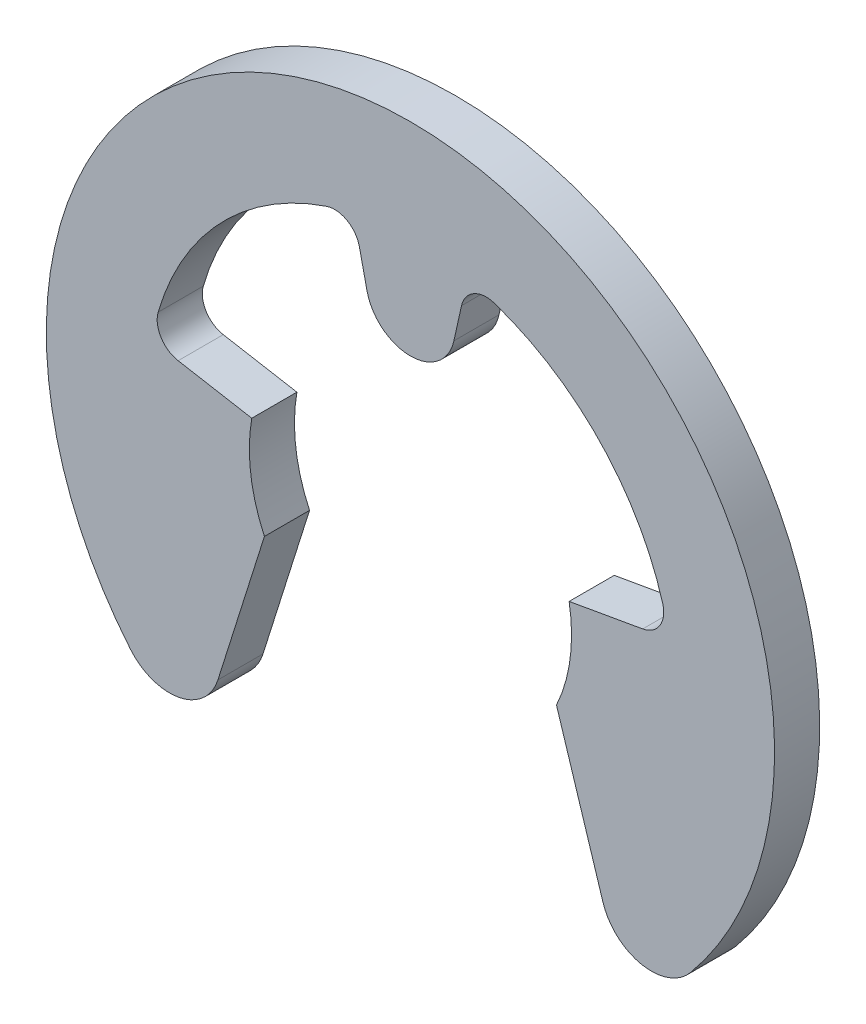
ISO-10303-21;
HEADER;
FILE_DESCRIPTION(('STEP AP214'),'2;1');
FILE_NAME('part.step','',(''),(''),'','','');
FILE_SCHEMA(('AUTOMOTIVE_DESIGN { 1 0 10303 214 1 1 1 1 }'));
ENDSEC;
DATA;
#1=APPLICATION_CONTEXT('core data for automotive mechanical design processes');
#2=APPLICATION_PROTOCOL_DEFINITION('international standard','automotive_design',2000,#1);
#3=PRODUCT_CONTEXT('',#1,'mechanical');
#4=PRODUCT('Part','Part','',(#3));
#5=PRODUCT_RELATED_PRODUCT_CATEGORY('part','',(#4));
#6=PRODUCT_DEFINITION_FORMATION('','',#4);
#7=PRODUCT_DEFINITION_CONTEXT('part definition',#1,'design');
#8=PRODUCT_DEFINITION('design','',#6,#7);
#9=PRODUCT_DEFINITION_SHAPE('','',#8);
#10=(LENGTH_UNIT() NAMED_UNIT(*) SI_UNIT(.MILLI.,.METRE.));
#11=(NAMED_UNIT(*) PLANE_ANGLE_UNIT() SI_UNIT($,.RADIAN.));
#12=(NAMED_UNIT(*) SI_UNIT($,.STERADIAN.) SOLID_ANGLE_UNIT());
#13=UNCERTAINTY_MEASURE_WITH_UNIT(LENGTH_MEASURE(1.E-05),#10,'distance_accuracy_value','');
#14=(GEOMETRIC_REPRESENTATION_CONTEXT(3) GLOBAL_UNCERTAINTY_ASSIGNED_CONTEXT((#13)) GLOBAL_UNIT_ASSIGNED_CONTEXT((#10,
#11,#12)) REPRESENTATION_CONTEXT('',''));
#15=CARTESIAN_POINT('',(0.,0.,0.));
#16=DIRECTION('',(0.,0.,1.));
#17=DIRECTION('',(1.,0.,0.));
#18=AXIS2_PLACEMENT_3D('',#15,#16,#17);
#19=CARTESIAN_POINT('',(0.,0.,-0.7));
#20=DIRECTION('',(0.,0.,1.));
#21=DIRECTION('',(1.,0.,0.));
#22=AXIS2_PLACEMENT_3D('',#19,#20,#21);
#23=CYLINDRICAL_SURFACE('',#22,2.5);
#24=CARTESIAN_POINT('',(0.,0.,0.));
#25=DIRECTION('',(0.,0.,-1.));
#26=DIRECTION('',(1.,0.,0.));
#27=AXIS2_PLACEMENT_3D('',#24,#25,#26);
#28=CIRCLE('',#27,2.5);
#29=CARTESIAN_POINT('',(2.46201938253052,0.434120444167318,0.));
#30=VERTEX_POINT('',#29);
#31=CARTESIAN_POINT('',(2.26576946759162,-1.05654565435176,0.));
#32=VERTEX_POINT('',#31);
#33=EDGE_CURVE('E198',#30,#32,#28,.T.);
#34=ORIENTED_EDGE('',*,*,#33,.F.);
#35=DIRECTION('',(0.,0.,1.));
#36=VECTOR('',#35,1.);
#37=CARTESIAN_POINT('',(2.46201938253052,0.434120444167318,-0.7));
#38=LINE('',#37,#36);
#39=CARTESIAN_POINT('',(2.46201938253052,0.434120444167318,-0.7));
#40=VERTEX_POINT('',#39);
#41=EDGE_CURVE('E13',#40,#30,#38,.T.);
#42=ORIENTED_EDGE('',*,*,#41,.F.);
#43=CARTESIAN_POINT('',(0.,0.,-0.7));
#44=DIRECTION('',(0.,0.,-1.));
#45=DIRECTION('',(1.,0.,0.));
#46=AXIS2_PLACEMENT_3D('',#43,#44,#45);
#47=CIRCLE('',#46,2.5);
#48=CARTESIAN_POINT('',(2.26576946759162,-1.05654565435176,-0.7));
#49=VERTEX_POINT('',#48);
#50=EDGE_CURVE('E248',#40,#49,#47,.T.);
#51=ORIENTED_EDGE('',*,*,#50,.T.);
#52=DIRECTION('',(0.,0.,1.));
#53=VECTOR('',#52,1.);
#54=CARTESIAN_POINT('',(2.26576946759162,-1.05654565435176,-0.7));
#55=LINE('',#54,#53);
#56=EDGE_CURVE('E44',#49,#32,#55,.T.);
#57=ORIENTED_EDGE('',*,*,#56,.T.);
#58=EDGE_LOOP('',(#34,#42,#51,#57));
#59=FACE_BOUND('',#58,.T.);
#60=ADVANCED_FACE('F41',(#59),#23,.F.);
#61=CARTESIAN_POINT('',(2.46201938253052,0.434120444167318,-0.7));
#62=DIRECTION('',(-0.173648177666928,0.984807753012209,0.));
#63=DIRECTION('',(-0.984807753012209,-0.173648177666928,0.));
#64=AXIS2_PLACEMENT_3D('',#61,#62,#63);
#65=PLANE('',#64);
#66=DIRECTION('',(-0.984807753012208,-0.173648177666928,0.));
#67=VECTOR('',#66,1.);
#68=CARTESIAN_POINT('',(2.46201938253052,0.434120444167318,0.));
#69=LINE('',#68,#67);
#70=CARTESIAN_POINT('',(3.60452586515531,0.635575162688392,0.));
#71=VERTEX_POINT('',#70);
#72=EDGE_CURVE('E246',#71,#30,#69,.T.);
#73=ORIENTED_EDGE('',*,*,#72,.F.);
#74=DIRECTION('',(0.,0.,1.));
#75=VECTOR('',#74,1.);
#76=CARTESIAN_POINT('',(3.60452586515531,0.635575162688392,-0.7));
#77=LINE('',#76,#75);
#78=CARTESIAN_POINT('',(3.60452586515531,0.635575162688392,-0.7));
#79=VERTEX_POINT('',#78);
#80=EDGE_CURVE('E50',#79,#71,#77,.T.);
#81=ORIENTED_EDGE('',*,*,#80,.F.);
#82=DIRECTION('',(-0.984807753012208,-0.173648177666928,0.));
#83=VECTOR('',#82,1.);
#84=CARTESIAN_POINT('',(2.46201938253052,0.434120444167318,-0.7));
#85=LINE('',#84,#83);
#86=EDGE_CURVE('E188',#79,#40,#85,.T.);
#87=ORIENTED_EDGE('',*,*,#86,.T.);
#88=ORIENTED_EDGE('',*,*,#41,.T.);
#89=EDGE_LOOP('',(#73,#81,#87,#88));
#90=FACE_BOUND('',#89,.T.);
#91=ADVANCED_FACE('F280',(#90),#65,.T.);
#92=CARTESIAN_POINT('',(3.53615189519896,1.02334321543695,-0.7));
#93=DIRECTION('',(0.,0.,1.));
#94=DIRECTION('',(1.,0.,0.));
#95=AXIS2_PLACEMENT_3D('',#92,#93,#94);
#96=CYLINDRICAL_SURFACE('',#95,0.39375);
#97=CARTESIAN_POINT('',(3.53615189519896,1.02334321543695,0.));
#98=DIRECTION('',(0.,0.,-1.));
#99=DIRECTION('',(1.,0.,0.));
#100=AXIS2_PLACEMENT_3D('',#97,#98,#99);
#101=CIRCLE('',#100,0.39375);
#102=CARTESIAN_POINT('',(3.91438206395538,1.13280097871798,0.));
#103=VERTEX_POINT('',#102);
#104=EDGE_CURVE('E175',#103,#71,#101,.T.);
#105=ORIENTED_EDGE('',*,*,#104,.F.);
#106=DIRECTION('',(0.,0.,1.));
#107=VECTOR('',#106,1.);
#108=CARTESIAN_POINT('',(3.91438206395538,1.13280097871798,-0.7));
#109=LINE('',#108,#107);
#110=CARTESIAN_POINT('',(3.91438206395538,1.13280097871798,-0.7));
#111=VERTEX_POINT('',#110);
#112=EDGE_CURVE('E170',#111,#103,#109,.T.);
#113=ORIENTED_EDGE('',*,*,#112,.F.);
#114=CARTESIAN_POINT('',(3.53615189519896,1.02334321543695,-0.7));
#115=DIRECTION('',(0.,0.,-1.));
#116=DIRECTION('',(1.,0.,0.));
#117=AXIS2_PLACEMENT_3D('',#114,#115,#116);
#118=CIRCLE('',#117,0.39375);
#119=EDGE_CURVE('E173',#111,#79,#118,.T.);
#120=ORIENTED_EDGE('',*,*,#119,.T.);
#121=ORIENTED_EDGE('',*,*,#80,.T.);
#122=EDGE_LOOP('',(#105,#113,#120,#121));
#123=FACE_BOUND('',#122,.T.);
#124=ADVANCED_FACE('F172',(#123),#96,.F.);
#125=CARTESIAN_POINT('',(0.,0.,-0.7));
#126=DIRECTION('',(0.,0.,1.));
#127=DIRECTION('',(1.,0.,0.));
#128=AXIS2_PLACEMENT_3D('',#125,#126,#127);
#129=CYLINDRICAL_SURFACE('',#128,4.075);
#130=CARTESIAN_POINT('',(0.,0.,0.));
#131=DIRECTION('',(0.,0.,-1.));
#132=DIRECTION('',(1.,0.,0.));
#133=AXIS2_PLACEMENT_3D('',#130,#131,#132);
#134=CIRCLE('',#133,4.075);
#135=CARTESIAN_POINT('',(1.30246575073799,3.86124435488801,0.));
#136=VERTEX_POINT('',#135);
#137=EDGE_CURVE('E243',#136,#103,#134,.T.);
#138=ORIENTED_EDGE('',*,*,#137,.F.);
#139=DIRECTION('',(0.,0.,1.));
#140=VECTOR('',#139,1.);
#141=CARTESIAN_POINT('',(1.30246575073799,3.86124435488801,-0.7));
#142=LINE('',#141,#140);
#143=CARTESIAN_POINT('',(1.30246575073799,3.86124435488801,-0.7));
#144=VERTEX_POINT('',#143);
#145=EDGE_CURVE('E180',#144,#136,#142,.T.);
#146=ORIENTED_EDGE('',*,*,#145,.F.);
#147=CARTESIAN_POINT('',(0.,0.,-0.7));
#148=DIRECTION('',(0.,0.,-1.));
#149=DIRECTION('',(1.,0.,0.));
#150=AXIS2_PLACEMENT_3D('',#147,#148,#149);
#151=CIRCLE('',#150,4.075);
#152=EDGE_CURVE('E186',#144,#111,#151,.T.);
#153=ORIENTED_EDGE('',*,*,#152,.T.);
#154=ORIENTED_EDGE('',*,*,#112,.T.);
#155=EDGE_LOOP('',(#138,#146,#153,#154));
#156=FACE_BOUND('',#155,.T.);
#157=ADVANCED_FACE('F190',(#156),#129,.F.);
#158=CARTESIAN_POINT('',(1.17661399874951,3.48814865802,-0.7));
#159=DIRECTION('',(0.,0.,1.));
#160=DIRECTION('',(1.,0.,0.));
#161=AXIS2_PLACEMENT_3D('',#158,#159,#160);
#162=CYLINDRICAL_SURFACE('',#161,0.39375);
#163=CARTESIAN_POINT('',(1.17661399874951,3.48814865802,0.));
#164=DIRECTION('',(0.,0.,-1.));
#165=DIRECTION('',(1.,0.,0.));
#166=AXIS2_PLACEMENT_3D('',#163,#164,#165);
#167=CIRCLE('',#166,0.39375);
#168=CARTESIAN_POINT('',(0.792197445946035,3.57337175600812,0.));
#169=VERTEX_POINT('',#168);
#170=EDGE_CURVE('E240',#169,#136,#167,.T.);
#171=ORIENTED_EDGE('',*,*,#170,.F.);
#172=DIRECTION('',(0.,0.,1.));
#173=VECTOR('',#172,1.);
#174=CARTESIAN_POINT('',(0.792197445946035,3.57337175600812,-0.7));
#175=LINE('',#174,#173);
#176=CARTESIAN_POINT('',(0.792197445946035,3.57337175600812,-0.7));
#177=VERTEX_POINT('',#176);
#178=EDGE_CURVE('E252',#177,#169,#175,.T.);
#179=ORIENTED_EDGE('',*,*,#178,.F.);
#180=CARTESIAN_POINT('',(1.17661399874951,3.48814865802,-0.7));
#181=DIRECTION('',(0.,0.,-1.));
#182=DIRECTION('',(1.,0.,0.));
#183=AXIS2_PLACEMENT_3D('',#180,#181,#182);
#184=CIRCLE('',#183,0.39375);
#185=EDGE_CURVE('E191',#177,#144,#184,.T.);
#186=ORIENTED_EDGE('',*,*,#185,.T.);
#187=ORIENTED_EDGE('',*,*,#145,.T.);
#188=EDGE_LOOP('',(#171,#179,#186,#187));
#189=FACE_BOUND('',#188,.T.);
#190=ADVANCED_FACE('F293',(#189),#162,.F.);
#191=CARTESIAN_POINT('',(0.674195424593791,3.04109903484525,-0.7));
#192=DIRECTION('',(0.976296007119933,-0.216439613938103,0.));
#193=DIRECTION('',(0.216439613938103,0.976296007119933,0.));
#194=AXIS2_PLACEMENT_3D('',#191,#192,#193);
#195=PLANE('',#194);
#196=DIRECTION('',(0.216439613938103,0.976296007119933,0.));
#197=VECTOR('',#196,1.);
#198=CARTESIAN_POINT('',(0.674195424593791,3.04109903484525,0.));
#199=LINE('',#198,#197);
#200=CARTESIAN_POINT('',(0.674195424593791,3.04109903484525,0.));
#201=VERTEX_POINT('',#200);
#202=EDGE_CURVE('E237',#201,#169,#199,.T.);
#203=ORIENTED_EDGE('',*,*,#202,.F.);
#204=DIRECTION('',(0.,0.,1.));
#205=VECTOR('',#204,1.);
#206=CARTESIAN_POINT('',(0.674195424593791,3.04109903484525,-0.7));
#207=LINE('',#206,#205);
#208=CARTESIAN_POINT('',(0.674195424593791,3.04109903484525,-0.7));
#209=VERTEX_POINT('',#208);
#210=EDGE_CURVE('E254',#209,#201,#207,.T.);
#211=ORIENTED_EDGE('',*,*,#210,.F.);
#212=DIRECTION('',(0.216439613938103,0.976296007119933,0.));
#213=VECTOR('',#212,1.);
#214=CARTESIAN_POINT('',(0.674195424593791,3.04109903484525,-0.7));
#215=LINE('',#214,#213);
#216=EDGE_CURVE('E193',#209,#177,#215,.T.);
#217=ORIENTED_EDGE('',*,*,#216,.T.);
#218=ORIENTED_EDGE('',*,*,#178,.T.);
#219=EDGE_LOOP('',(#203,#211,#217,#218));
#220=FACE_BOUND('',#219,.T.);
#221=ADVANCED_FACE('F296',(#220),#195,.T.);
#222=CARTESIAN_POINT('',(0.,3.19056456205598,-0.7));
#223=DIRECTION('',(0.,0.,1.));
#224=DIRECTION('',(1.,0.,0.));
#225=AXIS2_PLACEMENT_3D('',#222,#223,#224);
#226=CYLINDRICAL_SURFACE('',#225,0.690564562055992);
#227=CARTESIAN_POINT('',(0.,3.19056456205598,0.));
#228=DIRECTION('',(0.,0.,1.));
#229=DIRECTION('',(1.,0.,0.));
#230=AXIS2_PLACEMENT_3D('',#227,#228,#229);
#231=CIRCLE('',#230,0.690564562055992);
#232=CARTESIAN_POINT('',(-0.674195424593791,3.04109903484525,0.));
#233=VERTEX_POINT('',#232);
#234=EDGE_CURVE('E234',#233,#201,#231,.T.);
#235=ORIENTED_EDGE('',*,*,#234,.F.);
#236=DIRECTION('',(0.,0.,1.));
#237=VECTOR('',#236,1.);
#238=CARTESIAN_POINT('',(-0.674195424593791,3.04109903484525,-0.7));
#239=LINE('',#238,#237);
#240=CARTESIAN_POINT('',(-0.674195424593791,3.04109903484525,-0.7));
#241=VERTEX_POINT('',#240);
#242=EDGE_CURVE('E256',#241,#233,#239,.T.);
#243=ORIENTED_EDGE('',*,*,#242,.F.);
#244=CARTESIAN_POINT('',(0.,3.19056456205598,-0.7));
#245=DIRECTION('',(0.,0.,1.));
#246=DIRECTION('',(1.,0.,0.));
#247=AXIS2_PLACEMENT_3D('',#244,#245,#246);
#248=CIRCLE('',#247,0.690564562055992);
#249=EDGE_CURVE('E504',#241,#209,#248,.T.);
#250=ORIENTED_EDGE('',*,*,#249,.T.);
#251=ORIENTED_EDGE('',*,*,#210,.T.);
#252=EDGE_LOOP('',(#235,#243,#250,#251));
#253=FACE_BOUND('',#252,.T.);
#254=ADVANCED_FACE('F300',(#253),#226,.T.);
#255=CARTESIAN_POINT('',(-0.674195424593791,3.04109903484525,-0.7));
#256=DIRECTION('',(-0.976296007119933,-0.216439613938103,0.));
#257=DIRECTION('',(0.216439613938103,-0.976296007119933,0.));
#258=AXIS2_PLACEMENT_3D('',#255,#256,#257);
#259=PLANE('',#258);
#260=DIRECTION('',(0.216439613938103,-0.976296007119933,0.));
#261=VECTOR('',#260,1.);
#262=CARTESIAN_POINT('',(-0.674195424593791,3.04109903484525,0.));
#263=LINE('',#262,#261);
#264=CARTESIAN_POINT('',(-0.792197445946034,3.57337175600812,0.));
#265=VERTEX_POINT('',#264);
#266=EDGE_CURVE('E231',#265,#233,#263,.T.);
#267=ORIENTED_EDGE('',*,*,#266,.F.);
#268=DIRECTION('',(0.,0.,1.));
#269=VECTOR('',#268,1.);
#270=CARTESIAN_POINT('',(-0.792197445946034,3.57337175600812,-0.7));
#271=LINE('',#270,#269);
#272=CARTESIAN_POINT('',(-0.792197445946034,3.57337175600812,-0.7));
#273=VERTEX_POINT('',#272);
#274=EDGE_CURVE('E258',#273,#265,#271,.T.);
#275=ORIENTED_EDGE('',*,*,#274,.F.);
#276=DIRECTION('',(0.216439613938103,-0.976296007119933,0.));
#277=VECTOR('',#276,1.);
#278=CARTESIAN_POINT('',(-0.674195424593791,3.04109903484525,-0.7));
#279=LINE('',#278,#277);
#280=EDGE_CURVE('E508',#273,#241,#279,.T.);
#281=ORIENTED_EDGE('',*,*,#280,.T.);
#282=ORIENTED_EDGE('',*,*,#242,.T.);
#283=EDGE_LOOP('',(#267,#275,#281,#282));
#284=FACE_BOUND('',#283,.T.);
#285=ADVANCED_FACE('F304',(#284),#259,.T.);
#286=CARTESIAN_POINT('',(-1.17661399874951,3.48814865802,-0.7));
#287=DIRECTION('',(0.,0.,1.));
#288=DIRECTION('',(1.,0.,0.));
#289=AXIS2_PLACEMENT_3D('',#286,#287,#288);
#290=CYLINDRICAL_SURFACE('',#289,0.39375);
#291=CARTESIAN_POINT('',(-1.17661399874951,3.48814865802,0.));
#292=DIRECTION('',(0.,0.,-1.));
#293=DIRECTION('',(1.,0.,0.));
#294=AXIS2_PLACEMENT_3D('',#291,#292,#293);
#295=CIRCLE('',#294,0.39375);
#296=CARTESIAN_POINT('',(-1.302465750738,3.86124435488801,0.));
#297=VERTEX_POINT('',#296);
#298=EDGE_CURVE('E228',#297,#265,#295,.T.);
#299=ORIENTED_EDGE('',*,*,#298,.F.);
#300=DIRECTION('',(0.,0.,1.));
#301=VECTOR('',#300,1.);
#302=CARTESIAN_POINT('',(-1.302465750738,3.86124435488801,-0.7));
#303=LINE('',#302,#301);
#304=CARTESIAN_POINT('',(-1.302465750738,3.86124435488801,-0.7));
#305=VERTEX_POINT('',#304);
#306=EDGE_CURVE('E260',#305,#297,#303,.T.);
#307=ORIENTED_EDGE('',*,*,#306,.F.);
#308=CARTESIAN_POINT('',(-1.17661399874951,3.48814865802,-0.7));
#309=DIRECTION('',(0.,0.,-1.));
#310=DIRECTION('',(1.,0.,0.));
#311=AXIS2_PLACEMENT_3D('',#308,#309,#310);
#312=CIRCLE('',#311,0.39375);
#313=EDGE_CURVE('E497',#305,#273,#312,.T.);
#314=ORIENTED_EDGE('',*,*,#313,.T.);
#315=ORIENTED_EDGE('',*,*,#274,.T.);
#316=EDGE_LOOP('',(#299,#307,#314,#315));
#317=FACE_BOUND('',#316,.T.);
#318=ADVANCED_FACE('F308',(#317),#290,.F.);
#319=CARTESIAN_POINT('',(0.,0.,-0.7));
#320=DIRECTION('',(0.,0.,1.));
#321=DIRECTION('',(1.,0.,0.));
#322=AXIS2_PLACEMENT_3D('',#319,#320,#321);
#323=CYLINDRICAL_SURFACE('',#322,4.075);
#324=CARTESIAN_POINT('',(0.,0.,0.));
#325=DIRECTION('',(0.,0.,-1.));
#326=DIRECTION('',(1.,0.,0.));
#327=AXIS2_PLACEMENT_3D('',#324,#325,#326);
#328=CIRCLE('',#327,4.075);
#329=CARTESIAN_POINT('',(-3.91438206395538,1.13280097871798,0.));
#330=VERTEX_POINT('',#329);
#331=EDGE_CURVE('E225',#330,#297,#328,.T.);
#332=ORIENTED_EDGE('',*,*,#331,.F.);
#333=DIRECTION('',(0.,0.,1.));
#334=VECTOR('',#333,1.);
#335=CARTESIAN_POINT('',(-3.91438206395538,1.13280097871798,-0.7));
#336=LINE('',#335,#334);
#337=CARTESIAN_POINT('',(-3.91438206395538,1.13280097871798,-0.7));
#338=VERTEX_POINT('',#337);
#339=EDGE_CURVE('E262',#338,#330,#336,.T.);
#340=ORIENTED_EDGE('',*,*,#339,.F.);
#341=CARTESIAN_POINT('',(0.,0.,-0.7));
#342=DIRECTION('',(0.,0.,-1.));
#343=DIRECTION('',(1.,0.,0.));
#344=AXIS2_PLACEMENT_3D('',#341,#342,#343);
#345=CIRCLE('',#344,4.075);
#346=EDGE_CURVE('E493',#338,#305,#345,.T.);
#347=ORIENTED_EDGE('',*,*,#346,.T.);
#348=ORIENTED_EDGE('',*,*,#306,.T.);
#349=EDGE_LOOP('',(#332,#340,#347,#348));
#350=FACE_BOUND('',#349,.T.);
#351=ADVANCED_FACE('F312',(#350),#323,.F.);
#352=CARTESIAN_POINT('',(-3.53615189519896,1.02334321543695,-0.7));
#353=DIRECTION('',(0.,0.,1.));
#354=DIRECTION('',(1.,0.,0.));
#355=AXIS2_PLACEMENT_3D('',#352,#353,#354);
#356=CYLINDRICAL_SURFACE('',#355,0.39375);
#357=CARTESIAN_POINT('',(-3.53615189519896,1.02334321543695,0.));
#358=DIRECTION('',(0.,0.,-1.));
#359=DIRECTION('',(1.,0.,0.));
#360=AXIS2_PLACEMENT_3D('',#357,#358,#359);
#361=CIRCLE('',#360,0.39375);
#362=CARTESIAN_POINT('',(-3.60452586515531,0.635575162688392,0.));
#363=VERTEX_POINT('',#362);
#364=EDGE_CURVE('E222',#363,#330,#361,.T.);
#365=ORIENTED_EDGE('',*,*,#364,.F.);
#366=DIRECTION('',(0.,0.,1.));
#367=VECTOR('',#366,1.);
#368=CARTESIAN_POINT('',(-3.60452586515531,0.635575162688392,-0.7));
#369=LINE('',#368,#367);
#370=CARTESIAN_POINT('',(-3.60452586515531,0.635575162688392,-0.7));
#371=VERTEX_POINT('',#370);
#372=EDGE_CURVE('E264',#371,#363,#369,.T.);
#373=ORIENTED_EDGE('',*,*,#372,.F.);
#374=CARTESIAN_POINT('',(-3.53615189519896,1.02334321543695,-0.7));
#375=DIRECTION('',(0.,0.,-1.));
#376=DIRECTION('',(1.,0.,0.));
#377=AXIS2_PLACEMENT_3D('',#374,#375,#376);
#378=CIRCLE('',#377,0.39375);
#379=EDGE_CURVE('E514',#371,#338,#378,.T.);
#380=ORIENTED_EDGE('',*,*,#379,.T.);
#381=ORIENTED_EDGE('',*,*,#339,.T.);
#382=EDGE_LOOP('',(#365,#373,#380,#381));
#383=FACE_BOUND('',#382,.T.);
#384=ADVANCED_FACE('F316',(#383),#356,.F.);
#385=CARTESIAN_POINT('',(-2.46201938253052,0.434120444167318,-0.7));
#386=DIRECTION('',(0.173648177666928,0.984807753012209,0.));
#387=DIRECTION('',(-0.984807753012209,0.173648177666928,0.));
#388=AXIS2_PLACEMENT_3D('',#385,#386,#387);
#389=PLANE('',#388);
#390=DIRECTION('',(-0.984807753012208,0.173648177666928,0.));
#391=VECTOR('',#390,1.);
#392=CARTESIAN_POINT('',(-2.46201938253052,0.434120444167318,0.));
#393=LINE('',#392,#391);
#394=CARTESIAN_POINT('',(-2.46201938253052,0.434120444167318,0.));
#395=VERTEX_POINT('',#394);
#396=EDGE_CURVE('E219',#395,#363,#393,.T.);
#397=ORIENTED_EDGE('',*,*,#396,.F.);
#398=DIRECTION('',(0.,0.,1.));
#399=VECTOR('',#398,1.);
#400=CARTESIAN_POINT('',(-2.46201938253052,0.434120444167318,-0.7));
#401=LINE('',#400,#399);
#402=CARTESIAN_POINT('',(-2.46201938253052,0.434120444167318,-0.7));
#403=VERTEX_POINT('',#402);
#404=EDGE_CURVE('E266',#403,#395,#401,.T.);
#405=ORIENTED_EDGE('',*,*,#404,.F.);
#406=DIRECTION('',(-0.984807753012208,0.173648177666928,0.));
#407=VECTOR('',#406,1.);
#408=CARTESIAN_POINT('',(-2.46201938253052,0.434120444167318,-0.7));
#409=LINE('',#408,#407);
#410=EDGE_CURVE('E486',#403,#371,#409,.T.);
#411=ORIENTED_EDGE('',*,*,#410,.T.);
#412=ORIENTED_EDGE('',*,*,#372,.T.);
#413=EDGE_LOOP('',(#397,#405,#411,#412));
#414=FACE_BOUND('',#413,.T.);
#415=ADVANCED_FACE('F320',(#414),#389,.T.);
#416=CARTESIAN_POINT('',(0.,0.,-0.7));
#417=DIRECTION('',(0.,0.,1.));
#418=DIRECTION('',(1.,0.,0.));
#419=AXIS2_PLACEMENT_3D('',#416,#417,#418);
#420=CYLINDRICAL_SURFACE('',#419,2.5);
#421=CARTESIAN_POINT('',(0.,0.,0.));
#422=DIRECTION('',(0.,0.,-1.));
#423=DIRECTION('',(1.,0.,0.));
#424=AXIS2_PLACEMENT_3D('',#421,#422,#423);
#425=CIRCLE('',#424,2.5);
#426=CARTESIAN_POINT('',(-2.26576946759162,-1.05654565435176,0.));
#427=VERTEX_POINT('',#426);
#428=EDGE_CURVE('E216',#427,#395,#425,.T.);
#429=ORIENTED_EDGE('',*,*,#428,.F.);
#430=DIRECTION('',(0.,0.,1.));
#431=VECTOR('',#430,1.);
#432=CARTESIAN_POINT('',(-2.26576946759162,-1.05654565435176,-0.7));
#433=LINE('',#432,#431);
#434=CARTESIAN_POINT('',(-2.26576946759162,-1.05654565435176,-0.7));
#435=VERTEX_POINT('',#434);
#436=EDGE_CURVE('E268',#435,#427,#433,.T.);
#437=ORIENTED_EDGE('',*,*,#436,.F.);
#438=CARTESIAN_POINT('',(0.,0.,-0.7));
#439=DIRECTION('',(0.,0.,-1.));
#440=DIRECTION('',(1.,0.,0.));
#441=AXIS2_PLACEMENT_3D('',#438,#439,#440);
#442=CIRCLE('',#441,2.5);
#443=EDGE_CURVE('E482',#435,#403,#442,.T.);
#444=ORIENTED_EDGE('',*,*,#443,.T.);
#445=ORIENTED_EDGE('',*,*,#404,.T.);
#446=EDGE_LOOP('',(#429,#437,#444,#445));
#447=FACE_BOUND('',#446,.T.);
#448=ADVANCED_FACE('F324',(#447),#420,.F.);
#449=CARTESIAN_POINT('',(-2.26576946759162,-1.05654565435176,-0.7));
#450=DIRECTION('',(0.953716950748227,-0.300705799504273,0.));
#451=DIRECTION('',(0.300705799504273,0.953716950748227,0.));
#452=AXIS2_PLACEMENT_3D('',#449,#450,#451);
#453=PLANE('',#452);
#454=DIRECTION('',(0.300705799504273,0.953716950748227,0.));
#455=VECTOR('',#454,1.);
#456=CARTESIAN_POINT('',(-2.26576946759162,-1.05654565435176,0.));
#457=LINE('',#456,#455);
#458=CARTESIAN_POINT('',(-2.98759714932915,-3.34589057795238,0.));
#459=VERTEX_POINT('',#458);
#460=EDGE_CURVE('E213',#459,#427,#457,.T.);
#461=ORIENTED_EDGE('',*,*,#460,.F.);
#462=DIRECTION('',(0.,0.,1.));
#463=VECTOR('',#462,1.);
#464=CARTESIAN_POINT('',(-2.98759714932915,-3.34589057795238,-0.7));
#465=LINE('',#464,#463);
#466=CARTESIAN_POINT('',(-2.98759714932915,-3.34589057795238,-0.7));
#467=VERTEX_POINT('',#466);
#468=EDGE_CURVE('E270',#467,#459,#465,.T.);
#469=ORIENTED_EDGE('',*,*,#468,.F.);
#470=DIRECTION('',(0.300705799504273,0.953716950748227,0.));
#471=VECTOR('',#470,1.);
#472=CARTESIAN_POINT('',(-2.26576946759162,-1.05654565435176,-0.7));
#473=LINE('',#472,#471);
#474=EDGE_CURVE('E518',#467,#435,#473,.T.);
#475=ORIENTED_EDGE('',*,*,#474,.T.);
#476=ORIENTED_EDGE('',*,*,#436,.T.);
#477=EDGE_LOOP('',(#461,#469,#475,#476));
#478=FACE_BOUND('',#477,.T.);
#479=ADVANCED_FACE('F328',(#478),#453,.T.);
#480=CARTESIAN_POINT('',(-3.73864924804338,-3.10908476084276,-0.7));
#481=DIRECTION('',(0.,0.,1.));
#482=DIRECTION('',(1.,0.,0.));
#483=AXIS2_PLACEMENT_3D('',#480,#481,#482);
#484=CYLINDRICAL_SURFACE('',#483,0.7875);
#485=CARTESIAN_POINT('',(-3.73864924804338,-3.10908476084276,0.));
#486=DIRECTION('',(0.,0.,1.));
#487=DIRECTION('',(1.,0.,0.));
#488=AXIS2_PLACEMENT_3D('',#485,#486,#487);
#489=CIRCLE('',#488,0.7875);
#490=CARTESIAN_POINT('',(-4.3441374296031,-3.61261262699468,0.));
#491=VERTEX_POINT('',#490);
#492=EDGE_CURVE('E210',#491,#459,#489,.T.);
#493=ORIENTED_EDGE('',*,*,#492,.F.);
#494=DIRECTION('',(0.,0.,1.));
#495=VECTOR('',#494,1.);
#496=CARTESIAN_POINT('',(-4.3441374296031,-3.61261262699468,-0.7));
#497=LINE('',#496,#495);
#498=CARTESIAN_POINT('',(-4.3441374296031,-3.61261262699468,-0.7));
#499=VERTEX_POINT('',#498);
#500=EDGE_CURVE('E272',#499,#491,#497,.T.);
#501=ORIENTED_EDGE('',*,*,#500,.F.);
#502=CARTESIAN_POINT('',(-3.73864924804338,-3.10908476084276,-0.7));
#503=DIRECTION('',(0.,0.,1.));
#504=DIRECTION('',(1.,0.,0.));
#505=AXIS2_PLACEMENT_3D('',#502,#503,#504);
#506=CIRCLE('',#505,0.7875);
#507=EDGE_CURVE('E475',#499,#467,#506,.T.);
#508=ORIENTED_EDGE('',*,*,#507,.T.);
#509=ORIENTED_EDGE('',*,*,#468,.T.);
#510=EDGE_LOOP('',(#493,#501,#508,#509));
#511=FACE_BOUND('',#510,.T.);
#512=ADVANCED_FACE('F332',(#511),#484,.T.);
#513=CARTESIAN_POINT('',(0.,0.,-0.7));
#514=DIRECTION('',(0.,0.,1.));
#515=DIRECTION('',(1.,0.,0.));
#516=AXIS2_PLACEMENT_3D('',#513,#514,#515);
#517=CYLINDRICAL_SURFACE('',#516,5.65);
#518=CARTESIAN_POINT('',(0.,0.,0.));
#519=DIRECTION('',(0.,0.,1.));
#520=DIRECTION('',(1.,0.,0.));
#521=AXIS2_PLACEMENT_3D('',#518,#519,#520);
#522=CIRCLE('',#521,5.65);
#523=CARTESIAN_POINT('',(4.3441374296031,-3.61261262699468,0.));
#524=VERTEX_POINT('',#523);
#525=EDGE_CURVE('E207',#524,#491,#522,.T.);
#526=ORIENTED_EDGE('',*,*,#525,.F.);
#527=DIRECTION('',(0.,0.,1.));
#528=VECTOR('',#527,1.);
#529=CARTESIAN_POINT('',(4.3441374296031,-3.61261262699468,-0.7));
#530=LINE('',#529,#528);
#531=CARTESIAN_POINT('',(4.3441374296031,-3.61261262699468,-0.7));
#532=VERTEX_POINT('',#531);
#533=EDGE_CURVE('E274',#532,#524,#530,.T.);
#534=ORIENTED_EDGE('',*,*,#533,.F.);
#535=CARTESIAN_POINT('',(0.,0.,-0.7));
#536=DIRECTION('',(0.,0.,1.));
#537=DIRECTION('',(1.,0.,0.));
#538=AXIS2_PLACEMENT_3D('',#535,#536,#537);
#539=CIRCLE('',#538,5.65);
#540=EDGE_CURVE('E471',#532,#499,#539,.T.);
#541=ORIENTED_EDGE('',*,*,#540,.T.);
#542=ORIENTED_EDGE('',*,*,#500,.T.);
#543=EDGE_LOOP('',(#526,#534,#541,#542));
#544=FACE_BOUND('',#543,.T.);
#545=ADVANCED_FACE('F336',(#544),#517,.T.);
#546=CARTESIAN_POINT('',(3.73864924804338,-3.10908476084276,-0.7));
#547=DIRECTION('',(0.,0.,1.));
#548=DIRECTION('',(1.,0.,0.));
#549=AXIS2_PLACEMENT_3D('',#546,#547,#548);
#550=CYLINDRICAL_SURFACE('',#549,0.7875);
#551=CARTESIAN_POINT('',(3.73864924804338,-3.10908476084276,0.));
#552=DIRECTION('',(0.,0.,1.));
#553=DIRECTION('',(1.,0.,0.));
#554=AXIS2_PLACEMENT_3D('',#551,#552,#553);
#555=CIRCLE('',#554,0.7875);
#556=CARTESIAN_POINT('',(2.98759714932915,-3.34589057795238,0.));
#557=VERTEX_POINT('',#556);
#558=EDGE_CURVE('E204',#557,#524,#555,.T.);
#559=ORIENTED_EDGE('',*,*,#558,.F.);
#560=DIRECTION('',(0.,0.,1.));
#561=VECTOR('',#560,1.);
#562=CARTESIAN_POINT('',(2.98759714932915,-3.34589057795238,-0.7));
#563=LINE('',#562,#561);
#564=CARTESIAN_POINT('',(2.98759714932915,-3.34589057795238,-0.7));
#565=VERTEX_POINT('',#564);
#566=EDGE_CURVE('E275',#565,#557,#563,.T.);
#567=ORIENTED_EDGE('',*,*,#566,.F.);
#568=CARTESIAN_POINT('',(3.73864924804338,-3.10908476084276,-0.7));
#569=DIRECTION('',(0.,0.,1.));
#570=DIRECTION('',(1.,0.,0.));
#571=AXIS2_PLACEMENT_3D('',#568,#569,#570);
#572=CIRCLE('',#571,0.7875);
#573=EDGE_CURVE('E522',#565,#532,#572,.T.);
#574=ORIENTED_EDGE('',*,*,#573,.T.);
#575=ORIENTED_EDGE('',*,*,#533,.T.);
#576=EDGE_LOOP('',(#559,#567,#574,#575));
#577=FACE_BOUND('',#576,.T.);
#578=ADVANCED_FACE('F340',(#577),#550,.T.);
#579=CARTESIAN_POINT('',(2.26576946759162,-1.05654565435176,-0.7));
#580=DIRECTION('',(-0.953716950748227,-0.300705799504273,0.));
#581=DIRECTION('',(0.300705799504273,-0.953716950748227,0.));
#582=AXIS2_PLACEMENT_3D('',#579,#580,#581);
#583=PLANE('',#582);
#584=DIRECTION('',(0.300705799504273,-0.953716950748227,0.));
#585=VECTOR('',#584,1.);
#586=CARTESIAN_POINT('',(2.26576946759162,-1.05654565435176,0.));
#587=LINE('',#586,#585);
#588=EDGE_CURVE('E201',#32,#557,#587,.T.);
#589=ORIENTED_EDGE('',*,*,#588,.F.);
#590=ORIENTED_EDGE('',*,*,#56,.F.);
#591=DIRECTION('',(0.300705799504273,-0.953716950748227,0.));
#592=VECTOR('',#591,1.);
#593=CARTESIAN_POINT('',(2.26576946759162,-1.05654565435176,-0.7));
#594=LINE('',#593,#592);
#595=EDGE_CURVE('E524',#49,#565,#594,.T.);
#596=ORIENTED_EDGE('',*,*,#595,.T.);
#597=ORIENTED_EDGE('',*,*,#566,.T.);
#598=EDGE_LOOP('',(#589,#590,#596,#597));
#599=FACE_BOUND('',#598,.T.);
#600=ADVANCED_FACE('F277',(#599),#583,.T.);
#601=CARTESIAN_POINT('',(0.,0.,-0.7));
#602=DIRECTION('',(0.,0.,1.));
#603=DIRECTION('',(1.,0.,0.));
#604=AXIS2_PLACEMENT_3D('',#601,#602,#603);
#605=PLANE('',#604);
#606=ORIENTED_EDGE('',*,*,#50,.F.);
#607=ORIENTED_EDGE('',*,*,#86,.F.);
#608=ORIENTED_EDGE('',*,*,#119,.F.);
#609=ORIENTED_EDGE('',*,*,#152,.F.);
#610=ORIENTED_EDGE('',*,*,#185,.F.);
#611=ORIENTED_EDGE('',*,*,#216,.F.);
#612=ORIENTED_EDGE('',*,*,#249,.F.);
#613=ORIENTED_EDGE('',*,*,#280,.F.);
#614=ORIENTED_EDGE('',*,*,#313,.F.);
#615=ORIENTED_EDGE('',*,*,#346,.F.);
#616=ORIENTED_EDGE('',*,*,#379,.F.);
#617=ORIENTED_EDGE('',*,*,#410,.F.);
#618=ORIENTED_EDGE('',*,*,#443,.F.);
#619=ORIENTED_EDGE('',*,*,#474,.F.);
#620=ORIENTED_EDGE('',*,*,#507,.F.);
#621=ORIENTED_EDGE('',*,*,#540,.F.);
#622=ORIENTED_EDGE('',*,*,#573,.F.);
#623=ORIENTED_EDGE('',*,*,#595,.F.);
#624=EDGE_LOOP('',(#606,#607,#608,#609,#610,#611,#612,#613,#614,#615,#616,#617,#618,#619,#620,
#621,#622,#623));
#625=FACE_BOUND('',#624,.T.);
#626=ADVANCED_FACE('F184',(#625),#605,.F.);
#627=CARTESIAN_POINT('',(0.,0.,0.));
#628=DIRECTION('',(0.,0.,1.));
#629=DIRECTION('',(1.,0.,0.));
#630=AXIS2_PLACEMENT_3D('',#627,#628,#629);
#631=PLANE('',#630);
#632=ORIENTED_EDGE('',*,*,#33,.T.);
#633=ORIENTED_EDGE('',*,*,#588,.T.);
#634=ORIENTED_EDGE('',*,*,#558,.T.);
#635=ORIENTED_EDGE('',*,*,#525,.T.);
#636=ORIENTED_EDGE('',*,*,#492,.T.);
#637=ORIENTED_EDGE('',*,*,#460,.T.);
#638=ORIENTED_EDGE('',*,*,#428,.T.);
#639=ORIENTED_EDGE('',*,*,#396,.T.);
#640=ORIENTED_EDGE('',*,*,#364,.T.);
#641=ORIENTED_EDGE('',*,*,#331,.T.);
#642=ORIENTED_EDGE('',*,*,#298,.T.);
#643=ORIENTED_EDGE('',*,*,#266,.T.);
#644=ORIENTED_EDGE('',*,*,#234,.T.);
#645=ORIENTED_EDGE('',*,*,#202,.T.);
#646=ORIENTED_EDGE('',*,*,#170,.T.);
#647=ORIENTED_EDGE('',*,*,#137,.T.);
#648=ORIENTED_EDGE('',*,*,#104,.T.);
#649=ORIENTED_EDGE('',*,*,#72,.T.);
#650=EDGE_LOOP('',(#632,#633,#634,#635,#636,#637,#638,#639,#640,#641,#642,#643,#644,#645,#646,
#647,#648,#649));
#651=FACE_BOUND('',#650,.T.);
#652=ADVANCED_FACE('F279',(#651),#631,.T.);
#653=CLOSED_SHELL('',(#60,#91,#124,#157,#190,#221,#254,#285,#318,#351,#384,#415,#448,#479,#512,
#545,#578,#600,#626,#652));
#654=MANIFOLD_SOLID_BREP('B2',#653);
#655=ADVANCED_BREP_SHAPE_REPRESENTATION('',(#18,#654),#14);
#656=SHAPE_DEFINITION_REPRESENTATION(#9,#655);
ENDSEC;
END-ISO-10303-21;
